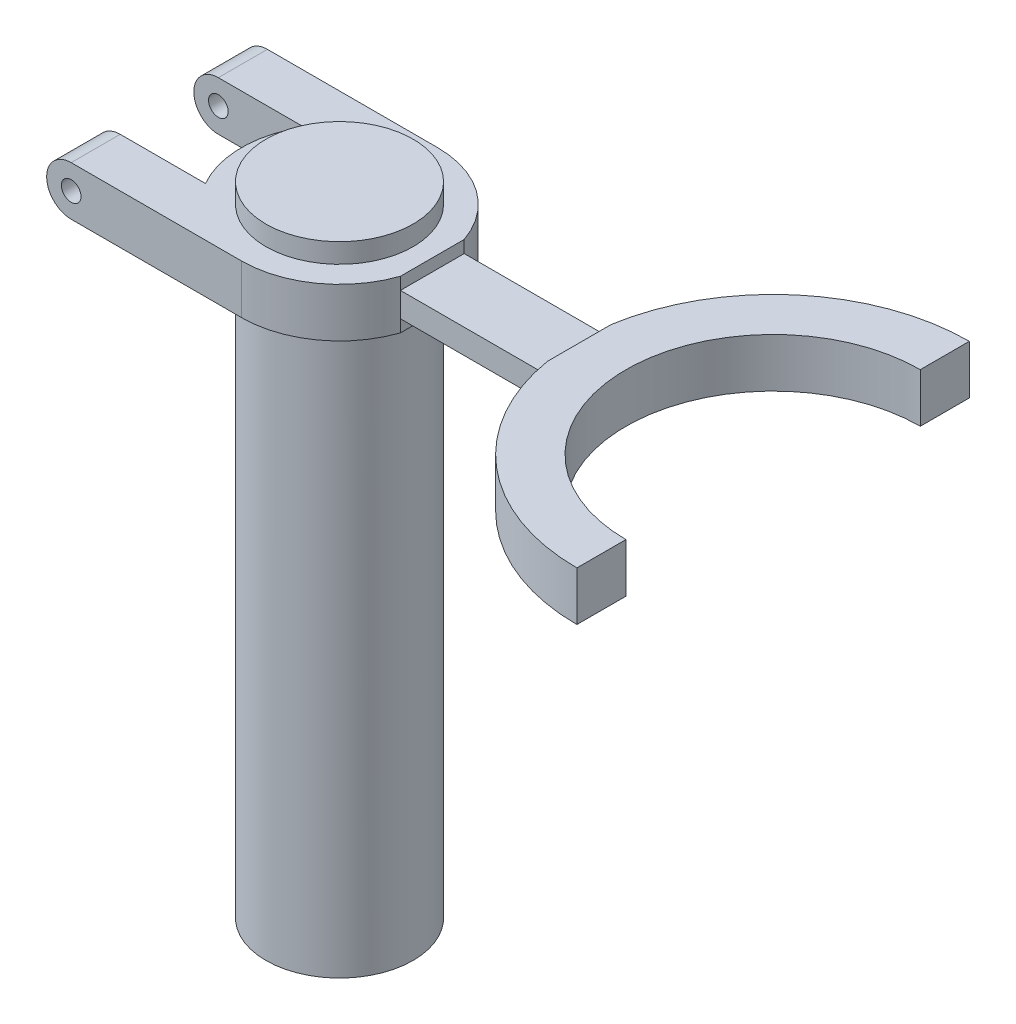
ISO-10303-21;
HEADER;
FILE_DESCRIPTION(('STEP AP214'),'2;1');
FILE_NAME('part.step','',(''),(''),'','','');
FILE_SCHEMA(('AUTOMOTIVE_DESIGN { 1 0 10303 214 1 1 1 1 }'));
ENDSEC;
DATA;
#1=APPLICATION_CONTEXT('core data for automotive mechanical design processes');
#2=APPLICATION_PROTOCOL_DEFINITION('international standard','automotive_design',2000,#1);
#3=PRODUCT_CONTEXT('',#1,'mechanical');
#4=PRODUCT('Part','Part','',(#3));
#5=PRODUCT_RELATED_PRODUCT_CATEGORY('part','',(#4));
#6=PRODUCT_DEFINITION_FORMATION('','',#4);
#7=PRODUCT_DEFINITION_CONTEXT('part definition',#1,'design');
#8=PRODUCT_DEFINITION('design','',#6,#7);
#9=PRODUCT_DEFINITION_SHAPE('','',#8);
#10=(LENGTH_UNIT() NAMED_UNIT(*) SI_UNIT(.MILLI.,.METRE.));
#11=(NAMED_UNIT(*) PLANE_ANGLE_UNIT() SI_UNIT($,.RADIAN.));
#12=(NAMED_UNIT(*) SI_UNIT($,.STERADIAN.) SOLID_ANGLE_UNIT());
#13=UNCERTAINTY_MEASURE_WITH_UNIT(LENGTH_MEASURE(1.E-05),#10,'distance_accuracy_value','');
#14=(GEOMETRIC_REPRESENTATION_CONTEXT(3) GLOBAL_UNCERTAINTY_ASSIGNED_CONTEXT((#13)) GLOBAL_UNIT_ASSIGNED_CONTEXT((#10,
#11,#12)) REPRESENTATION_CONTEXT('',''));
#15=CARTESIAN_POINT('',(0.,0.,0.));
#16=DIRECTION('',(0.,0.,1.));
#17=DIRECTION('',(1.,0.,0.));
#18=AXIS2_PLACEMENT_3D('',#15,#16,#17);
#19=CARTESIAN_POINT('',(0.,0.,0.));
#20=DIRECTION('',(0.,1.,0.));
#21=DIRECTION('',(0.,0.,1.));
#22=AXIS2_PLACEMENT_3D('',#19,#20,#21);
#23=PLANE('',#22);
#24=CARTESIAN_POINT('',(88.3826220631095,0.,0.));
#25=DIRECTION('',(0.,1.,0.));
#26=DIRECTION('',(0.,0.,1.));
#27=AXIS2_PLACEMENT_3D('',#24,#25,#26);
#28=CIRCLE('',#27,40.);
#29=CARTESIAN_POINT('',(48.9142803193777,0.,6.50000000000008));
#30=VERTEX_POINT('',#29);
#31=CARTESIAN_POINT('',(88.3826220631095,0.,40.));
#32=VERTEX_POINT('',#31);
#33=EDGE_CURVE('E254',#30,#32,#28,.T.);
#34=ORIENTED_EDGE('',*,*,#33,.F.);
#35=DIRECTION('',(0.,0.,1.));
#36=VECTOR('',#35,1.);
#37=CARTESIAN_POINT('',(48.9142803193777,0.,-40.));
#38=LINE('',#37,#36);
#39=CARTESIAN_POINT('',(48.9142803193777,0.,-6.5));
#40=VERTEX_POINT('',#39);
#41=EDGE_CURVE('E248',#40,#30,#38,.T.);
#42=ORIENTED_EDGE('',*,*,#41,.F.);
#43=CARTESIAN_POINT('',(88.3826220631095,0.,-40.));
#44=VERTEX_POINT('',#43);
#45=EDGE_CURVE('E262',#44,#40,#28,.T.);
#46=ORIENTED_EDGE('',*,*,#45,.F.);
#47=DIRECTION('',(0.,0.,1.));
#48=VECTOR('',#47,1.);
#49=CARTESIAN_POINT('',(88.3826220631095,0.,0.));
#50=LINE('',#49,#48);
#51=CARTESIAN_POINT('',(88.3826220631095,0.,-30.));
#52=VERTEX_POINT('',#51);
#53=EDGE_CURVE('E276',#44,#52,#50,.T.);
#54=ORIENTED_EDGE('',*,*,#53,.T.);
#55=CARTESIAN_POINT('',(88.3826220631095,0.,0.));
#56=DIRECTION('',(0.,1.,0.));
#57=DIRECTION('',(0.,0.,1.));
#58=AXIS2_PLACEMENT_3D('',#55,#56,#57);
#59=CIRCLE('',#58,30.);
#60=CARTESIAN_POINT('',(88.3826220631095,0.,30.));
#61=VERTEX_POINT('',#60);
#62=EDGE_CURVE('E282',#52,#61,#59,.T.);
#63=ORIENTED_EDGE('',*,*,#62,.T.);
#64=EDGE_CURVE('E260',#61,#32,#50,.T.);
#65=ORIENTED_EDGE('',*,*,#64,.T.);
#66=EDGE_LOOP('',(#34,#42,#46,#54,#63,#65));
#67=FACE_BOUND('',#66,.T.);
#68=ADVANCED_FACE('F85',(#67),#23,.F.);
#69=CARTESIAN_POINT('',(0.,10.,0.));
#70=DIRECTION('',(0.,1.,0.));
#71=DIRECTION('',(0.,0.,1.));
#72=AXIS2_PLACEMENT_3D('',#69,#70,#71);
#73=PLANE('',#72);
#74=DIRECTION('',(0.,0.,1.));
#75=VECTOR('',#74,1.);
#76=CARTESIAN_POINT('',(18.9142803193777,10.,-40.));
#77=LINE('',#76,#75);
#78=CARTESIAN_POINT('',(18.9142803193777,10.,-6.5));
#79=VERTEX_POINT('',#78);
#80=CARTESIAN_POINT('',(18.9142803193777,10.,6.5));
#81=VERTEX_POINT('',#80);
#82=EDGE_CURVE('E236',#79,#81,#77,.T.);
#83=ORIENTED_EDGE('',*,*,#82,.F.);
#84=CARTESIAN_POINT('',(0.,10.,0.));
#85=DIRECTION('',(0.,1.,0.));
#86=DIRECTION('',(0.,0.,1.));
#87=AXIS2_PLACEMENT_3D('',#84,#85,#86);
#88=CIRCLE('',#87,20.);
#89=CARTESIAN_POINT('',(0.,10.,-20.));
#90=VERTEX_POINT('',#89);
#91=EDGE_CURVE('E398',#79,#90,#88,.T.);
#92=ORIENTED_EDGE('',*,*,#91,.T.);
#93=DIRECTION('',(-1.,0.,0.));
#94=VECTOR('',#93,1.);
#95=CARTESIAN_POINT('',(0.,10.,-20.));
#96=LINE('',#95,#94);
#97=CARTESIAN_POINT('',(-34.7,10.,-20.));
#98=VERTEX_POINT('',#97);
#99=EDGE_CURVE('E411',#90,#98,#96,.T.);
#100=ORIENTED_EDGE('',*,*,#99,.T.);
#101=DIRECTION('',(0.,0.,1.));
#102=VECTOR('',#101,1.);
#103=CARTESIAN_POINT('',(-34.7,10.,-40.));
#104=LINE('',#103,#102);
#105=CARTESIAN_POINT('',(-34.7,10.,-10.));
#106=VERTEX_POINT('',#105);
#107=EDGE_CURVE('E350',#98,#106,#104,.T.);
#108=ORIENTED_EDGE('',*,*,#107,.T.);
#109=DIRECTION('',(-1.,0.,0.));
#110=VECTOR('',#109,1.);
#111=CARTESIAN_POINT('',(0.,10.,-10.));
#112=LINE('',#111,#110);
#113=CARTESIAN_POINT('',(-17.3205080756888,10.,-10.));
#114=VERTEX_POINT('',#113);
#115=EDGE_CURVE('E415',#114,#106,#112,.T.);
#116=ORIENTED_EDGE('',*,*,#115,.F.);
#117=CARTESIAN_POINT('',(0.,10.,0.));
#118=DIRECTION('',(0.,1.,0.));
#119=DIRECTION('',(0.,0.,1.));
#120=AXIS2_PLACEMENT_3D('',#117,#118,#119);
#121=CIRCLE('',#120,20.);
#122=CARTESIAN_POINT('',(-17.3205080756888,10.,10.));
#123=VERTEX_POINT('',#122);
#124=EDGE_CURVE('E419',#114,#123,#121,.T.);
#125=ORIENTED_EDGE('',*,*,#124,.T.);
#126=DIRECTION('',(-1.,0.,0.));
#127=VECTOR('',#126,1.);
#128=CARTESIAN_POINT('',(0.,10.,10.));
#129=LINE('',#128,#127);
#130=CARTESIAN_POINT('',(-34.7,10.,10.));
#131=VERTEX_POINT('',#130);
#132=EDGE_CURVE('E422',#123,#131,#129,.T.);
#133=ORIENTED_EDGE('',*,*,#132,.T.);
#134=CARTESIAN_POINT('',(-34.7,10.,20.));
#135=VERTEX_POINT('',#134);
#136=EDGE_CURVE('E346',#131,#135,#104,.T.);
#137=ORIENTED_EDGE('',*,*,#136,.T.);
#138=DIRECTION('',(-1.,0.,0.));
#139=VECTOR('',#138,1.);
#140=CARTESIAN_POINT('',(0.,10.,20.));
#141=LINE('',#140,#139);
#142=CARTESIAN_POINT('',(0.,10.,20.));
#143=VERTEX_POINT('',#142);
#144=EDGE_CURVE('E300',#143,#135,#141,.T.);
#145=ORIENTED_EDGE('',*,*,#144,.F.);
#146=EDGE_CURVE('E393',#143,#81,#88,.T.);
#147=ORIENTED_EDGE('',*,*,#146,.T.);
#148=EDGE_LOOP('',(#83,#92,#100,#108,#116,#125,#133,#137,#145,#147));
#149=FACE_BOUND('',#148,.T.);
#150=CARTESIAN_POINT('',(0.,10.,0.));
#151=DIRECTION('',(0.,1.,0.));
#152=DIRECTION('',(0.,0.,1.));
#153=AXIS2_PLACEMENT_3D('',#150,#151,#152);
#154=CIRCLE('',#153,15.);
#155=CARTESIAN_POINT('',(0.,10.,15.));
#156=VERTEX_POINT('',#155);
#157=EDGE_CURVE('E306',#156,#156,#154,.T.);
#158=ORIENTED_EDGE('',*,*,#157,.F.);
#159=EDGE_LOOP('',(#158));
#160=FACE_BOUND('',#159,.T.);
#161=ADVANCED_FACE('F433',(#149,#160),#73,.T.);
#162=CARTESIAN_POINT('',(0.,10.,6.5));
#163=DIRECTION('',(0.,0.,-1.));
#164=DIRECTION('',(-1.,0.,0.));
#165=AXIS2_PLACEMENT_3D('',#162,#163,#164);
#166=PLANE('',#165);
#167=DIRECTION('',(0.,-1.,0.));
#168=VECTOR('',#167,1.);
#169=CARTESIAN_POINT('',(48.9142803193777,10.,6.5));
#170=LINE('',#169,#168);
#171=CARTESIAN_POINT('',(48.9142803193777,7.5,6.50000000000008));
#172=VERTEX_POINT('',#171);
#173=CARTESIAN_POINT('',(48.9142803193777,2.5,6.50000000000008));
#174=VERTEX_POINT('',#173);
#175=EDGE_CURVE('E335',#172,#174,#170,.T.);
#176=ORIENTED_EDGE('',*,*,#175,.F.);
#177=DIRECTION('',(-1.,0.,0.));
#178=VECTOR('',#177,1.);
#179=CARTESIAN_POINT('',(0.,7.5,6.5));
#180=LINE('',#179,#178);
#181=CARTESIAN_POINT('',(18.9142803193777,7.5,6.5));
#182=VERTEX_POINT('',#181);
#183=EDGE_CURVE('E531',#172,#182,#180,.T.);
#184=ORIENTED_EDGE('',*,*,#183,.T.);
#185=DIRECTION('',(0.,-1.,0.));
#186=VECTOR('',#185,1.);
#187=CARTESIAN_POINT('',(18.9142803193777,10.,6.5));
#188=LINE('',#187,#186);
#189=CARTESIAN_POINT('',(18.9142803193777,2.5,6.5));
#190=VERTEX_POINT('',#189);
#191=EDGE_CURVE('E340',#182,#190,#188,.T.);
#192=ORIENTED_EDGE('',*,*,#191,.T.);
#193=DIRECTION('',(-1.,0.,0.));
#194=VECTOR('',#193,1.);
#195=CARTESIAN_POINT('',(0.,2.5,6.5));
#196=LINE('',#195,#194);
#197=EDGE_CURVE('E517',#174,#190,#196,.T.);
#198=ORIENTED_EDGE('',*,*,#197,.F.);
#199=EDGE_LOOP('',(#176,#184,#192,#198));
#200=FACE_BOUND('',#199,.T.);
#201=ADVANCED_FACE('F435',(#200),#166,.F.);
#202=CARTESIAN_POINT('',(0.,10.,-6.5));
#203=DIRECTION('',(0.,0.,-1.));
#204=DIRECTION('',(-1.,0.,0.));
#205=AXIS2_PLACEMENT_3D('',#202,#203,#204);
#206=PLANE('',#205);
#207=DIRECTION('',(-1.,0.,0.));
#208=VECTOR('',#207,1.);
#209=CARTESIAN_POINT('',(0.,7.5,-6.5));
#210=LINE('',#209,#208);
#211=CARTESIAN_POINT('',(48.9142803193777,7.5,-6.5));
#212=VERTEX_POINT('',#211);
#213=CARTESIAN_POINT('',(18.9142803193777,7.5,-6.5));
#214=VERTEX_POINT('',#213);
#215=EDGE_CURVE('E526',#212,#214,#210,.T.);
#216=ORIENTED_EDGE('',*,*,#215,.F.);
#217=DIRECTION('',(0.,-1.,0.));
#218=VECTOR('',#217,1.);
#219=CARTESIAN_POINT('',(48.9142803193777,10.,-6.5));
#220=LINE('',#219,#218);
#221=CARTESIAN_POINT('',(48.9142803193777,2.5,-6.5));
#222=VERTEX_POINT('',#221);
#223=EDGE_CURVE('E323',#212,#222,#220,.T.);
#224=ORIENTED_EDGE('',*,*,#223,.T.);
#225=DIRECTION('',(-1.,0.,0.));
#226=VECTOR('',#225,1.);
#227=CARTESIAN_POINT('',(0.,2.5,-6.5));
#228=LINE('',#227,#226);
#229=CARTESIAN_POINT('',(18.9142803193777,2.5,-6.5));
#230=VERTEX_POINT('',#229);
#231=EDGE_CURVE('E235',#222,#230,#228,.T.);
#232=ORIENTED_EDGE('',*,*,#231,.T.);
#233=DIRECTION('',(0.,-1.,0.));
#234=VECTOR('',#233,1.);
#235=CARTESIAN_POINT('',(18.9142803193777,10.,-6.5));
#236=LINE('',#235,#234);
#237=EDGE_CURVE('E318',#214,#230,#236,.T.);
#238=ORIENTED_EDGE('',*,*,#237,.F.);
#239=EDGE_LOOP('',(#216,#224,#232,#238));
#240=FACE_BOUND('',#239,.T.);
#241=ADVANCED_FACE('F443',(#240),#206,.T.);
#242=CARTESIAN_POINT('',(0.,10.,20.));
#243=DIRECTION('',(0.,0.,1.));
#244=DIRECTION('',(1.,0.,0.));
#245=AXIS2_PLACEMENT_3D('',#242,#243,#244);
#246=PLANE('',#245);
#247=CARTESIAN_POINT('',(-34.7,5.,20.));
#248=DIRECTION('',(0.,0.,1.));
#249=DIRECTION('',(1.,0.,0.));
#250=AXIS2_PLACEMENT_3D('',#247,#248,#249);
#251=CIRCLE('',#250,2.);
#252=CARTESIAN_POINT('',(-32.7,5.,20.));
#253=VERTEX_POINT('',#252);
#254=EDGE_CURVE('E358',#253,#253,#251,.T.);
#255=ORIENTED_EDGE('',*,*,#254,.F.);
#256=EDGE_LOOP('',(#255));
#257=FACE_BOUND('',#256,.T.);
#258=CARTESIAN_POINT('',(-34.7,5.,20.));
#259=DIRECTION('',(0.,0.,1.));
#260=DIRECTION('',(1.,0.,0.));
#261=AXIS2_PLACEMENT_3D('',#258,#259,#260);
#262=CIRCLE('',#261,5.);
#263=CARTESIAN_POINT('',(-34.7,0.,20.));
#264=VERTEX_POINT('',#263);
#265=EDGE_CURVE('E380',#135,#264,#262,.T.);
#266=ORIENTED_EDGE('',*,*,#265,.T.);
#267=DIRECTION('',(-1.,0.,0.));
#268=VECTOR('',#267,1.);
#269=CARTESIAN_POINT('',(0.,0.,20.));
#270=LINE('',#269,#268);
#271=CARTESIAN_POINT('',(0.,0.,20.));
#272=VERTEX_POINT('',#271);
#273=EDGE_CURVE('E255',#272,#264,#270,.T.);
#274=ORIENTED_EDGE('',*,*,#273,.F.);
#275=DIRECTION('',(0.,-1.,0.));
#276=VECTOR('',#275,1.);
#277=CARTESIAN_POINT('',(0.,10.,20.));
#278=LINE('',#277,#276);
#279=EDGE_CURVE('E252',#143,#272,#278,.T.);
#280=ORIENTED_EDGE('',*,*,#279,.F.);
#281=ORIENTED_EDGE('',*,*,#144,.T.);
#282=EDGE_LOOP('',(#266,#274,#280,#281));
#283=FACE_BOUND('',#282,.T.);
#284=ADVANCED_FACE('F87',(#257,#283),#246,.T.);
#285=CARTESIAN_POINT('',(0.,10.,-20.));
#286=DIRECTION('',(0.,0.,1.));
#287=DIRECTION('',(1.,0.,0.));
#288=AXIS2_PLACEMENT_3D('',#285,#286,#287);
#289=PLANE('',#288);
#290=CARTESIAN_POINT('',(-34.7,5.,-20.));
#291=DIRECTION('',(0.,0.,1.));
#292=DIRECTION('',(1.,0.,0.));
#293=AXIS2_PLACEMENT_3D('',#290,#291,#292);
#294=CIRCLE('',#293,2.);
#295=CARTESIAN_POINT('',(-32.7,5.,-20.));
#296=VERTEX_POINT('',#295);
#297=EDGE_CURVE('E364',#296,#296,#294,.T.);
#298=ORIENTED_EDGE('',*,*,#297,.T.);
#299=EDGE_LOOP('',(#298));
#300=FACE_BOUND('',#299,.T.);
#301=DIRECTION('',(-1.,0.,0.));
#302=VECTOR('',#301,1.);
#303=CARTESIAN_POINT('',(0.,0.,-20.));
#304=LINE('',#303,#302);
#305=CARTESIAN_POINT('',(0.,0.,-20.));
#306=VERTEX_POINT('',#305);
#307=CARTESIAN_POINT('',(-34.7,0.,-20.));
#308=VERTEX_POINT('',#307);
#309=EDGE_CURVE('E266',#306,#308,#304,.T.);
#310=ORIENTED_EDGE('',*,*,#309,.T.);
#311=CARTESIAN_POINT('',(-34.7,5.,-20.));
#312=DIRECTION('',(0.,0.,1.));
#313=DIRECTION('',(1.,0.,0.));
#314=AXIS2_PLACEMENT_3D('',#311,#312,#313);
#315=CIRCLE('',#314,5.);
#316=EDGE_CURVE('E263',#98,#308,#315,.T.);
#317=ORIENTED_EDGE('',*,*,#316,.F.);
#318=ORIENTED_EDGE('',*,*,#99,.F.);
#319=DIRECTION('',(0.,-1.,0.));
#320=VECTOR('',#319,1.);
#321=CARTESIAN_POINT('',(0.,10.,-20.));
#322=LINE('',#321,#320);
#323=EDGE_CURVE('E309',#90,#306,#322,.T.);
#324=ORIENTED_EDGE('',*,*,#323,.T.);
#325=EDGE_LOOP('',(#310,#317,#318,#324));
#326=FACE_BOUND('',#325,.T.);
#327=ADVANCED_FACE('F495',(#300,#326),#289,.F.);
#328=CARTESIAN_POINT('',(0.,10.,-10.));
#329=DIRECTION('',(0.,0.,1.));
#330=DIRECTION('',(1.,0.,0.));
#331=AXIS2_PLACEMENT_3D('',#328,#329,#330);
#332=PLANE('',#331);
#333=CARTESIAN_POINT('',(-34.7,5.,-9.99999999999999));
#334=DIRECTION('',(0.,0.,1.));
#335=DIRECTION('',(1.,0.,0.));
#336=AXIS2_PLACEMENT_3D('',#333,#334,#335);
#337=CIRCLE('',#336,2.);
#338=CARTESIAN_POINT('',(-32.7,5.,-9.99999999999999));
#339=VERTEX_POINT('',#338);
#340=EDGE_CURVE('E357',#339,#339,#337,.T.);
#341=ORIENTED_EDGE('',*,*,#340,.F.);
#342=EDGE_LOOP('',(#341));
#343=FACE_BOUND('',#342,.T.);
#344=CARTESIAN_POINT('',(-34.7,5.,-9.99999999999999));
#345=DIRECTION('',(0.,0.,1.));
#346=DIRECTION('',(1.,0.,0.));
#347=AXIS2_PLACEMENT_3D('',#344,#345,#346);
#348=CIRCLE('',#347,5.);
#349=CARTESIAN_POINT('',(-34.7,0.,-9.99999999999999));
#350=VERTEX_POINT('',#349);
#351=EDGE_CURVE('E109',#106,#350,#348,.T.);
#352=ORIENTED_EDGE('',*,*,#351,.T.);
#353=DIRECTION('',(-1.,0.,0.));
#354=VECTOR('',#353,1.);
#355=CARTESIAN_POINT('',(0.,0.,-10.));
#356=LINE('',#355,#354);
#357=CARTESIAN_POINT('',(-17.3205080756888,0.,-10.));
#358=VERTEX_POINT('',#357);
#359=EDGE_CURVE('E273',#358,#350,#356,.T.);
#360=ORIENTED_EDGE('',*,*,#359,.F.);
#361=DIRECTION('',(0.,-1.,0.));
#362=VECTOR('',#361,1.);
#363=CARTESIAN_POINT('',(-17.3205080756888,10.,-10.));
#364=LINE('',#363,#362);
#365=EDGE_CURVE('E305',#114,#358,#364,.T.);
#366=ORIENTED_EDGE('',*,*,#365,.F.);
#367=ORIENTED_EDGE('',*,*,#115,.T.);
#368=EDGE_LOOP('',(#352,#360,#366,#367));
#369=FACE_BOUND('',#368,.T.);
#370=ADVANCED_FACE('F587',(#343,#369),#332,.T.);
#371=CARTESIAN_POINT('',(0.,10.,10.));
#372=DIRECTION('',(0.,0.,1.));
#373=DIRECTION('',(1.,0.,0.));
#374=AXIS2_PLACEMENT_3D('',#371,#372,#373);
#375=PLANE('',#374);
#376=CARTESIAN_POINT('',(-34.7,5.,10.));
#377=DIRECTION('',(0.,0.,1.));
#378=DIRECTION('',(1.,0.,0.));
#379=AXIS2_PLACEMENT_3D('',#376,#377,#378);
#380=CIRCLE('',#379,2.);
#381=CARTESIAN_POINT('',(-32.7,5.,10.));
#382=VERTEX_POINT('',#381);
#383=EDGE_CURVE('E354',#382,#382,#380,.T.);
#384=ORIENTED_EDGE('',*,*,#383,.T.);
#385=EDGE_LOOP('',(#384));
#386=FACE_BOUND('',#385,.T.);
#387=DIRECTION('',(-1.,0.,0.));
#388=VECTOR('',#387,1.);
#389=CARTESIAN_POINT('',(0.,0.,10.));
#390=LINE('',#389,#388);
#391=CARTESIAN_POINT('',(-17.3205080756888,0.,10.));
#392=VERTEX_POINT('',#391);
#393=CARTESIAN_POINT('',(-34.7,0.,10.));
#394=VERTEX_POINT('',#393);
#395=EDGE_CURVE('E296',#392,#394,#390,.T.);
#396=ORIENTED_EDGE('',*,*,#395,.T.);
#397=CARTESIAN_POINT('',(-34.7,5.,10.));
#398=DIRECTION('',(0.,0.,1.));
#399=DIRECTION('',(1.,0.,0.));
#400=AXIS2_PLACEMENT_3D('',#397,#398,#399);
#401=CIRCLE('',#400,5.);
#402=EDGE_CURVE('E383',#131,#394,#401,.T.);
#403=ORIENTED_EDGE('',*,*,#402,.F.);
#404=ORIENTED_EDGE('',*,*,#132,.F.);
#405=DIRECTION('',(0.,-1.,0.));
#406=VECTOR('',#405,1.);
#407=CARTESIAN_POINT('',(-17.3205080756888,10.,10.));
#408=LINE('',#407,#406);
#409=EDGE_CURVE('E301',#123,#392,#408,.T.);
#410=ORIENTED_EDGE('',*,*,#409,.T.);
#411=EDGE_LOOP('',(#396,#403,#404,#410));
#412=FACE_BOUND('',#411,.T.);
#413=ADVANCED_FACE('F458',(#386,#412),#375,.F.);
#414=CARTESIAN_POINT('',(0.,0.,0.));
#415=DIRECTION('',(0.,1.,0.));
#416=DIRECTION('',(0.,0.,1.));
#417=AXIS2_PLACEMENT_3D('',#414,#415,#416);
#418=CIRCLE('',#417,15.);
#419=CARTESIAN_POINT('',(0.,0.,15.));
#420=VERTEX_POINT('',#419);
#421=EDGE_CURVE('E12',#420,#420,#418,.F.);
#422=ORIENTED_EDGE('',*,*,#421,.F.);
#423=EDGE_LOOP('',(#422));
#424=FACE_BOUND('',#423,.T.);
#425=CARTESIAN_POINT('',(0.,0.,0.));
#426=DIRECTION('',(0.,1.,0.));
#427=DIRECTION('',(0.,0.,1.));
#428=AXIS2_PLACEMENT_3D('',#425,#426,#427);
#429=CIRCLE('',#428,20.);
#430=CARTESIAN_POINT('',(18.9142803193777,0.,-6.5));
#431=VERTEX_POINT('',#430);
#432=EDGE_CURVE('E246',#431,#306,#429,.T.);
#433=ORIENTED_EDGE('',*,*,#432,.F.);
#434=DIRECTION('',(0.,0.,1.));
#435=VECTOR('',#434,1.);
#436=CARTESIAN_POINT('',(18.9142803193777,0.,-40.));
#437=LINE('',#436,#435);
#438=CARTESIAN_POINT('',(18.9142803193777,0.,6.5));
#439=VERTEX_POINT('',#438);
#440=EDGE_CURVE('E226',#431,#439,#437,.T.);
#441=ORIENTED_EDGE('',*,*,#440,.T.);
#442=EDGE_CURVE('E243',#272,#439,#429,.T.);
#443=ORIENTED_EDGE('',*,*,#442,.F.);
#444=ORIENTED_EDGE('',*,*,#273,.T.);
#445=DIRECTION('',(0.,0.,1.));
#446=VECTOR('',#445,1.);
#447=CARTESIAN_POINT('',(-34.7,0.,-40.));
#448=LINE('',#447,#446);
#449=EDGE_CURVE('E351',#394,#264,#448,.T.);
#450=ORIENTED_EDGE('',*,*,#449,.F.);
#451=ORIENTED_EDGE('',*,*,#395,.F.);
#452=CARTESIAN_POINT('',(0.,0.,0.));
#453=DIRECTION('',(0.,1.,0.));
#454=DIRECTION('',(0.,0.,1.));
#455=AXIS2_PLACEMENT_3D('',#452,#453,#454);
#456=CIRCLE('',#455,20.);
#457=EDGE_CURVE('E293',#358,#392,#456,.T.);
#458=ORIENTED_EDGE('',*,*,#457,.F.);
#459=ORIENTED_EDGE('',*,*,#359,.T.);
#460=EDGE_CURVE('E94',#308,#350,#448,.T.);
#461=ORIENTED_EDGE('',*,*,#460,.F.);
#462=ORIENTED_EDGE('',*,*,#309,.F.);
#463=EDGE_LOOP('',(#433,#441,#443,#444,#450,#451,#458,#459,#461,#462));
#464=FACE_BOUND('',#463,.T.);
#465=ADVANCED_FACE('F241',(#424,#464),#23,.F.);
#466=DIRECTION('',(0.,0.,1.));
#467=VECTOR('',#466,1.);
#468=CARTESIAN_POINT('',(48.9142803193777,10.,-40.));
#469=LINE('',#468,#467);
#470=CARTESIAN_POINT('',(48.9142803193777,10.,-6.5));
#471=VERTEX_POINT('',#470);
#472=CARTESIAN_POINT('',(48.9142803193777,10.,6.50000000000008));
#473=VERTEX_POINT('',#472);
#474=EDGE_CURVE('E462',#471,#473,#469,.T.);
#475=ORIENTED_EDGE('',*,*,#474,.T.);
#476=CARTESIAN_POINT('',(88.3826220631095,10.,0.));
#477=DIRECTION('',(0.,1.,0.));
#478=DIRECTION('',(0.,0.,1.));
#479=AXIS2_PLACEMENT_3D('',#476,#477,#478);
#480=CIRCLE('',#479,40.);
#481=CARTESIAN_POINT('',(88.3826220631095,10.,40.));
#482=VERTEX_POINT('',#481);
#483=EDGE_CURVE('E397',#473,#482,#480,.T.);
#484=ORIENTED_EDGE('',*,*,#483,.T.);
#485=DIRECTION('',(0.,0.,1.));
#486=VECTOR('',#485,1.);
#487=CARTESIAN_POINT('',(88.3826220631095,10.,0.));
#488=LINE('',#487,#486);
#489=CARTESIAN_POINT('',(88.3826220631095,10.,30.));
#490=VERTEX_POINT('',#489);
#491=EDGE_CURVE('E401',#490,#482,#488,.T.);
#492=ORIENTED_EDGE('',*,*,#491,.F.);
#493=CARTESIAN_POINT('',(88.3826220631095,10.,0.));
#494=DIRECTION('',(0.,1.,0.));
#495=DIRECTION('',(0.,0.,1.));
#496=AXIS2_PLACEMENT_3D('',#493,#494,#495);
#497=CIRCLE('',#496,30.);
#498=CARTESIAN_POINT('',(88.3826220631095,10.,-30.));
#499=VERTEX_POINT('',#498);
#500=EDGE_CURVE('E406',#499,#490,#497,.T.);
#501=ORIENTED_EDGE('',*,*,#500,.F.);
#502=CARTESIAN_POINT('',(88.3826220631095,10.,-40.));
#503=VERTEX_POINT('',#502);
#504=EDGE_CURVE('E407',#503,#499,#488,.T.);
#505=ORIENTED_EDGE('',*,*,#504,.F.);
#506=EDGE_CURVE('E402',#503,#471,#480,.T.);
#507=ORIENTED_EDGE('',*,*,#506,.T.);
#508=EDGE_LOOP('',(#475,#484,#492,#501,#505,#507));
#509=FACE_BOUND('',#508,.T.);
#510=ADVANCED_FACE('F438',(#509),#73,.T.);
#511=CARTESIAN_POINT('',(0.,10.,0.));
#512=DIRECTION('',(0.,-1.,0.));
#513=DIRECTION('',(0.,0.,-1.));
#514=AXIS2_PLACEMENT_3D('',#511,#512,#513);
#515=CYLINDRICAL_SURFACE('',#514,20.);
#516=ORIENTED_EDGE('',*,*,#442,.T.);
#517=DIRECTION('',(0.,1.,0.));
#518=VECTOR('',#517,1.);
#519=CARTESIAN_POINT('',(18.9142803193777,10.,6.5));
#520=LINE('',#519,#518);
#521=EDGE_CURVE('E223',#439,#190,#520,.T.);
#522=ORIENTED_EDGE('',*,*,#521,.T.);
#523=ORIENTED_EDGE('',*,*,#191,.F.);
#524=EDGE_CURVE('E341',#81,#182,#188,.T.);
#525=ORIENTED_EDGE('',*,*,#524,.F.);
#526=ORIENTED_EDGE('',*,*,#146,.F.);
#527=ORIENTED_EDGE('',*,*,#279,.T.);
#528=EDGE_LOOP('',(#516,#522,#523,#525,#526,#527));
#529=FACE_BOUND('',#528,.T.);
#530=ADVANCED_FACE('F250',(#529),#515,.T.);
#531=CARTESIAN_POINT('',(88.3826220631095,10.,0.));
#532=DIRECTION('',(0.,-1.,0.));
#533=DIRECTION('',(0.,0.,-1.));
#534=AXIS2_PLACEMENT_3D('',#531,#532,#533);
#535=CYLINDRICAL_SURFACE('',#534,40.);
#536=ORIENTED_EDGE('',*,*,#33,.T.);
#537=DIRECTION('',(0.,-1.,0.));
#538=VECTOR('',#537,1.);
#539=CARTESIAN_POINT('',(88.3826220631095,10.,40.));
#540=LINE('',#539,#538);
#541=EDGE_CURVE('E332',#482,#32,#540,.T.);
#542=ORIENTED_EDGE('',*,*,#541,.F.);
#543=ORIENTED_EDGE('',*,*,#483,.F.);
#544=EDGE_CURVE('E336',#473,#172,#170,.T.);
#545=ORIENTED_EDGE('',*,*,#544,.T.);
#546=ORIENTED_EDGE('',*,*,#175,.T.);
#547=DIRECTION('',(0.,-1.,0.));
#548=VECTOR('',#547,1.);
#549=CARTESIAN_POINT('',(48.9142803193777,10.,6.50000000000008));
#550=LINE('',#549,#548);
#551=EDGE_CURVE('E535',#174,#30,#550,.T.);
#552=ORIENTED_EDGE('',*,*,#551,.T.);
#553=EDGE_LOOP('',(#536,#542,#543,#545,#546,#552));
#554=FACE_BOUND('',#553,.T.);
#555=ADVANCED_FACE('F455',(#554),#535,.T.);
#556=CARTESIAN_POINT('',(88.3826220631095,10.,0.));
#557=DIRECTION('',(1.,0.,0.));
#558=DIRECTION('',(0.,0.,-1.));
#559=AXIS2_PLACEMENT_3D('',#556,#557,#558);
#560=PLANE('',#559);
#561=ORIENTED_EDGE('',*,*,#64,.F.);
#562=DIRECTION('',(0.,-1.,0.));
#563=VECTOR('',#562,1.);
#564=CARTESIAN_POINT('',(88.3826220631095,10.,30.));
#565=LINE('',#564,#563);
#566=EDGE_CURVE('E329',#490,#61,#565,.T.);
#567=ORIENTED_EDGE('',*,*,#566,.F.);
#568=ORIENTED_EDGE('',*,*,#491,.T.);
#569=ORIENTED_EDGE('',*,*,#541,.T.);
#570=EDGE_LOOP('',(#561,#567,#568,#569));
#571=FACE_BOUND('',#570,.T.);
#572=ADVANCED_FACE('F479',(#571),#560,.T.);
#573=CARTESIAN_POINT('',(88.3826220631095,10.,0.));
#574=DIRECTION('',(0.,-1.,0.));
#575=DIRECTION('',(0.,0.,-1.));
#576=AXIS2_PLACEMENT_3D('',#573,#574,#575);
#577=CYLINDRICAL_SURFACE('',#576,30.);
#578=ORIENTED_EDGE('',*,*,#62,.F.);
#579=DIRECTION('',(0.,-1.,0.));
#580=VECTOR('',#579,1.);
#581=CARTESIAN_POINT('',(88.3826220631095,10.,-30.));
#582=LINE('',#581,#580);
#583=EDGE_CURVE('E326',#499,#52,#582,.T.);
#584=ORIENTED_EDGE('',*,*,#583,.F.);
#585=ORIENTED_EDGE('',*,*,#500,.T.);
#586=ORIENTED_EDGE('',*,*,#566,.T.);
#587=EDGE_LOOP('',(#578,#584,#585,#586));
#588=FACE_BOUND('',#587,.T.);
#589=ADVANCED_FACE('F484',(#588),#577,.F.);
#590=ORIENTED_EDGE('',*,*,#53,.F.);
#591=DIRECTION('',(0.,-1.,0.));
#592=VECTOR('',#591,1.);
#593=CARTESIAN_POINT('',(88.3826220631095,10.,-40.));
#594=LINE('',#593,#592);
#595=EDGE_CURVE('E322',#503,#44,#594,.T.);
#596=ORIENTED_EDGE('',*,*,#595,.F.);
#597=ORIENTED_EDGE('',*,*,#504,.T.);
#598=ORIENTED_EDGE('',*,*,#583,.T.);
#599=EDGE_LOOP('',(#590,#596,#597,#598));
#600=FACE_BOUND('',#599,.T.);
#601=ADVANCED_FACE('F487',(#600),#560,.T.);
#602=ORIENTED_EDGE('',*,*,#45,.T.);
#603=EDGE_CURVE('E317',#222,#40,#220,.T.);
#604=ORIENTED_EDGE('',*,*,#603,.F.);
#605=ORIENTED_EDGE('',*,*,#223,.F.);
#606=EDGE_CURVE('E319',#471,#212,#220,.T.);
#607=ORIENTED_EDGE('',*,*,#606,.F.);
#608=ORIENTED_EDGE('',*,*,#506,.F.);
#609=ORIENTED_EDGE('',*,*,#595,.T.);
#610=EDGE_LOOP('',(#602,#604,#605,#607,#608,#609));
#611=FACE_BOUND('',#610,.T.);
#612=ADVANCED_FACE('F611',(#611),#535,.T.);
#613=ORIENTED_EDGE('',*,*,#432,.T.);
#614=ORIENTED_EDGE('',*,*,#323,.F.);
#615=ORIENTED_EDGE('',*,*,#91,.F.);
#616=EDGE_CURVE('E313',#79,#214,#236,.T.);
#617=ORIENTED_EDGE('',*,*,#616,.T.);
#618=ORIENTED_EDGE('',*,*,#237,.T.);
#619=EDGE_CURVE('E312',#230,#431,#236,.T.);
#620=ORIENTED_EDGE('',*,*,#619,.T.);
#621=EDGE_LOOP('',(#613,#614,#615,#617,#618,#620));
#622=FACE_BOUND('',#621,.T.);
#623=ADVANCED_FACE('F457',(#622),#515,.T.);
#624=CARTESIAN_POINT('',(0.,10.,0.));
#625=DIRECTION('',(0.,-1.,0.));
#626=DIRECTION('',(0.,0.,-1.));
#627=AXIS2_PLACEMENT_3D('',#624,#625,#626);
#628=CYLINDRICAL_SURFACE('',#627,20.);
#629=ORIENTED_EDGE('',*,*,#457,.T.);
#630=ORIENTED_EDGE('',*,*,#409,.F.);
#631=ORIENTED_EDGE('',*,*,#124,.F.);
#632=ORIENTED_EDGE('',*,*,#365,.T.);
#633=EDGE_LOOP('',(#629,#630,#631,#632));
#634=FACE_BOUND('',#633,.T.);
#635=ADVANCED_FACE('F571',(#634),#628,.T.);
#636=CARTESIAN_POINT('',(-34.7,5.,-40.));
#637=DIRECTION('',(0.,0.,1.));
#638=DIRECTION('',(1.,0.,0.));
#639=AXIS2_PLACEMENT_3D('',#636,#637,#638);
#640=CYLINDRICAL_SURFACE('',#639,5.);
#641=ORIENTED_EDGE('',*,*,#402,.T.);
#642=ORIENTED_EDGE('',*,*,#449,.T.);
#643=ORIENTED_EDGE('',*,*,#265,.F.);
#644=ORIENTED_EDGE('',*,*,#136,.F.);
#645=EDGE_LOOP('',(#641,#642,#643,#644));
#646=FACE_BOUND('',#645,.T.);
#647=ADVANCED_FACE('F566',(#646),#640,.T.);
#648=ORIENTED_EDGE('',*,*,#316,.T.);
#649=ORIENTED_EDGE('',*,*,#460,.T.);
#650=ORIENTED_EDGE('',*,*,#351,.F.);
#651=ORIENTED_EDGE('',*,*,#107,.F.);
#652=EDGE_LOOP('',(#648,#649,#650,#651));
#653=FACE_BOUND('',#652,.T.);
#654=ADVANCED_FACE('F497',(#653),#640,.T.);
#655=CARTESIAN_POINT('',(-34.7,5.,-40.));
#656=DIRECTION('',(0.,0.,1.));
#657=DIRECTION('',(1.,0.,0.));
#658=AXIS2_PLACEMENT_3D('',#655,#656,#657);
#659=CYLINDRICAL_SURFACE('',#658,2.);
#660=ORIENTED_EDGE('',*,*,#254,.T.);
#661=EDGE_LOOP('',(#660));
#662=FACE_BOUND('',#661,.T.);
#663=ORIENTED_EDGE('',*,*,#383,.F.);
#664=EDGE_LOOP('',(#663));
#665=FACE_BOUND('',#664,.T.);
#666=ADVANCED_FACE('F563',(#662,#665),#659,.F.);
#667=ORIENTED_EDGE('',*,*,#340,.T.);
#668=EDGE_LOOP('',(#667));
#669=FACE_BOUND('',#668,.T.);
#670=ORIENTED_EDGE('',*,*,#297,.F.);
#671=EDGE_LOOP('',(#670));
#672=FACE_BOUND('',#671,.T.);
#673=ADVANCED_FACE('F561',(#669,#672),#659,.F.);
#674=CARTESIAN_POINT('',(0.,14.,0.));
#675=DIRECTION('',(0.,-1.,0.));
#676=DIRECTION('',(0.,0.,-1.));
#677=AXIS2_PLACEMENT_3D('',#674,#675,#676);
#678=CYLINDRICAL_SURFACE('',#677,15.);
#679=ORIENTED_EDGE('',*,*,#157,.T.);
#680=EDGE_LOOP('',(#679));
#681=FACE_BOUND('',#680,.T.);
#682=CARTESIAN_POINT('',(0.,14.,0.));
#683=DIRECTION('',(0.,1.,0.));
#684=DIRECTION('',(0.,0.,1.));
#685=AXIS2_PLACEMENT_3D('',#682,#683,#684);
#686=CIRCLE('',#685,15.);
#687=CARTESIAN_POINT('',(0.,14.,15.));
#688=VERTEX_POINT('',#687);
#689=EDGE_CURVE('E367',#688,#688,#686,.T.);
#690=ORIENTED_EDGE('',*,*,#689,.F.);
#691=EDGE_LOOP('',(#690));
#692=FACE_BOUND('',#691,.T.);
#693=ADVANCED_FACE('F430',(#681,#692),#678,.T.);
#694=CARTESIAN_POINT('',(0.,14.,0.));
#695=DIRECTION('',(0.,1.,0.));
#696=DIRECTION('',(0.,0.,1.));
#697=AXIS2_PLACEMENT_3D('',#694,#695,#696);
#698=PLANE('',#697);
#699=ORIENTED_EDGE('',*,*,#689,.T.);
#700=EDGE_LOOP('',(#699));
#701=FACE_BOUND('',#700,.T.);
#702=ADVANCED_FACE('F546',(#701),#698,.T.);
#703=CARTESIAN_POINT('',(0.,-116.,0.));
#704=DIRECTION('',(0.,1.,0.));
#705=DIRECTION('',(0.,0.,1.));
#706=AXIS2_PLACEMENT_3D('',#703,#704,#705);
#707=CYLINDRICAL_SURFACE('',#706,15.);
#708=CARTESIAN_POINT('',(0.,-116.,0.));
#709=DIRECTION('',(0.,-1.,0.));
#710=DIRECTION('',(0.,0.,-1.));
#711=AXIS2_PLACEMENT_3D('',#708,#709,#710);
#712=CIRCLE('',#711,15.);
#713=CARTESIAN_POINT('',(0.,-116.,-15.));
#714=VERTEX_POINT('',#713);
#715=EDGE_CURVE('E373',#714,#714,#712,.T.);
#716=ORIENTED_EDGE('',*,*,#715,.F.);
#717=EDGE_LOOP('',(#716));
#718=FACE_BOUND('',#717,.T.);
#719=ORIENTED_EDGE('',*,*,#421,.T.);
#720=EDGE_LOOP('',(#719));
#721=FACE_BOUND('',#720,.T.);
#722=ADVANCED_FACE('F543',(#718,#721),#707,.T.);
#723=CARTESIAN_POINT('',(0.,-116.,0.));
#724=DIRECTION('',(0.,-1.,0.));
#725=DIRECTION('',(0.,0.,-1.));
#726=AXIS2_PLACEMENT_3D('',#723,#724,#725);
#727=PLANE('',#726);
#728=ORIENTED_EDGE('',*,*,#715,.T.);
#729=EDGE_LOOP('',(#728));
#730=FACE_BOUND('',#729,.T.);
#731=ADVANCED_FACE('F541',(#730),#727,.T.);
#732=CARTESIAN_POINT('',(48.9142803193777,0.,-40.));
#733=DIRECTION('',(1.,0.,0.));
#734=DIRECTION('',(0.,0.,-1.));
#735=AXIS2_PLACEMENT_3D('',#732,#733,#734);
#736=PLANE('',#735);
#737=DIRECTION('',(0.,0.,1.));
#738=VECTOR('',#737,1.);
#739=CARTESIAN_POINT('',(48.9142803193777,2.5,-40.));
#740=LINE('',#739,#738);
#741=EDGE_CURVE('E597',#222,#174,#740,.T.);
#742=ORIENTED_EDGE('',*,*,#741,.F.);
#743=ORIENTED_EDGE('',*,*,#603,.T.);
#744=ORIENTED_EDGE('',*,*,#41,.T.);
#745=ORIENTED_EDGE('',*,*,#551,.F.);
#746=EDGE_LOOP('',(#742,#743,#744,#745));
#747=FACE_BOUND('',#746,.T.);
#748=ADVANCED_FACE('F553',(#747),#736,.F.);
#749=CARTESIAN_POINT('',(0.,2.5,-40.));
#750=DIRECTION('',(0.,-1.,0.));
#751=DIRECTION('',(1.,0.,0.));
#752=AXIS2_PLACEMENT_3D('',#749,#750,#751);
#753=PLANE('',#752);
#754=ORIENTED_EDGE('',*,*,#197,.T.);
#755=DIRECTION('',(0.,0.,1.));
#756=VECTOR('',#755,1.);
#757=CARTESIAN_POINT('',(18.9142803193777,2.5,-40.));
#758=LINE('',#757,#756);
#759=EDGE_CURVE('E229',#230,#190,#758,.T.);
#760=ORIENTED_EDGE('',*,*,#759,.F.);
#761=ORIENTED_EDGE('',*,*,#231,.F.);
#762=ORIENTED_EDGE('',*,*,#741,.T.);
#763=EDGE_LOOP('',(#754,#760,#761,#762));
#764=FACE_BOUND('',#763,.T.);
#765=ADVANCED_FACE('F513',(#764),#753,.T.);
#766=CARTESIAN_POINT('',(18.9142803193777,0.,-40.));
#767=DIRECTION('',(-1.,0.,0.));
#768=DIRECTION('',(0.,0.,1.));
#769=AXIS2_PLACEMENT_3D('',#766,#767,#768);
#770=PLANE('',#769);
#771=ORIENTED_EDGE('',*,*,#440,.F.);
#772=ORIENTED_EDGE('',*,*,#619,.F.);
#773=ORIENTED_EDGE('',*,*,#759,.T.);
#774=ORIENTED_EDGE('',*,*,#521,.F.);
#775=EDGE_LOOP('',(#771,#772,#773,#774));
#776=FACE_BOUND('',#775,.T.);
#777=ADVANCED_FACE('F225',(#776),#770,.F.);
#778=CARTESIAN_POINT('',(48.9142803193777,0.,-40.));
#779=DIRECTION('',(1.,0.,0.));
#780=DIRECTION('',(0.,0.,-1.));
#781=AXIS2_PLACEMENT_3D('',#778,#779,#780);
#782=PLANE('',#781);
#783=ORIENTED_EDGE('',*,*,#474,.F.);
#784=ORIENTED_EDGE('',*,*,#606,.T.);
#785=DIRECTION('',(0.,0.,1.));
#786=VECTOR('',#785,1.);
#787=CARTESIAN_POINT('',(48.9142803193777,7.5,-40.));
#788=LINE('',#787,#786);
#789=EDGE_CURVE('E471',#212,#172,#788,.T.);
#790=ORIENTED_EDGE('',*,*,#789,.T.);
#791=ORIENTED_EDGE('',*,*,#544,.F.);
#792=EDGE_LOOP('',(#783,#784,#790,#791));
#793=FACE_BOUND('',#792,.T.);
#794=ADVANCED_FACE('F610',(#793),#782,.F.);
#795=CARTESIAN_POINT('',(18.9142803193777,0.,-40.));
#796=DIRECTION('',(-1.,0.,0.));
#797=DIRECTION('',(0.,0.,1.));
#798=AXIS2_PLACEMENT_3D('',#795,#796,#797);
#799=PLANE('',#798);
#800=DIRECTION('',(0.,0.,1.));
#801=VECTOR('',#800,1.);
#802=CARTESIAN_POINT('',(18.9142803193777,7.5,-40.));
#803=LINE('',#802,#801);
#804=EDGE_CURVE('E101',#214,#182,#803,.T.);
#805=ORIENTED_EDGE('',*,*,#804,.F.);
#806=ORIENTED_EDGE('',*,*,#616,.F.);
#807=ORIENTED_EDGE('',*,*,#82,.T.);
#808=ORIENTED_EDGE('',*,*,#524,.T.);
#809=EDGE_LOOP('',(#805,#806,#807,#808));
#810=FACE_BOUND('',#809,.T.);
#811=ADVANCED_FACE('F591',(#810),#799,.F.);
#812=CARTESIAN_POINT('',(0.,7.5,-40.));
#813=DIRECTION('',(0.,-1.,0.));
#814=DIRECTION('',(0.,0.,-1.));
#815=AXIS2_PLACEMENT_3D('',#812,#813,#814);
#816=PLANE('',#815);
#817=ORIENTED_EDGE('',*,*,#789,.F.);
#818=ORIENTED_EDGE('',*,*,#215,.T.);
#819=ORIENTED_EDGE('',*,*,#804,.T.);
#820=ORIENTED_EDGE('',*,*,#183,.F.);
#821=EDGE_LOOP('',(#817,#818,#819,#820));
#822=FACE_BOUND('',#821,.T.);
#823=ADVANCED_FACE('F594',(#822),#816,.F.);
#824=CLOSED_SHELL('',(#68,#161,#201,#241,#284,#327,#370,#413,#465,#510,#530,#555,#572,#589,#601,
#612,#623,#635,#647,#654,#666,#673,#693,#702,#722,#731,#748,#765,#777,#794,#811,#823));
#825=MANIFOLD_SOLID_BREP('B2',#824);
#826=ADVANCED_BREP_SHAPE_REPRESENTATION('',(#18,#825),#14);
#827=SHAPE_DEFINITION_REPRESENTATION(#9,#826);
ENDSEC;
END-ISO-10303-21;
